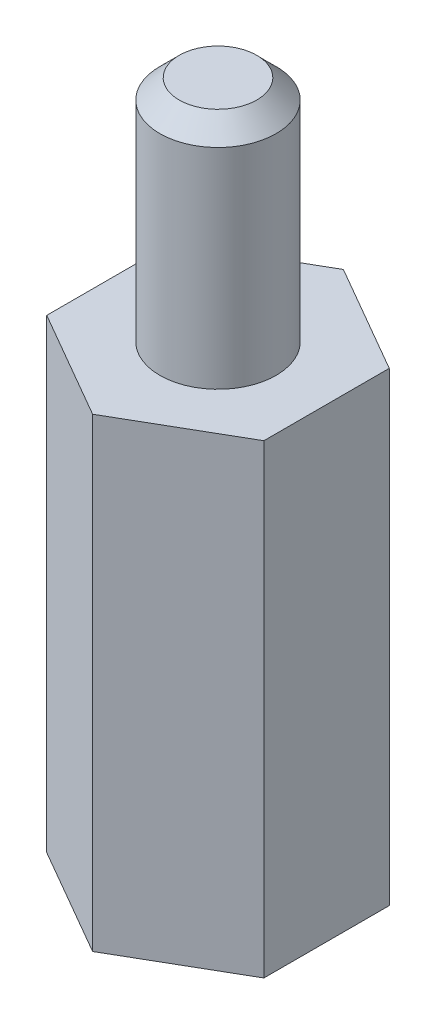
ISO-10303-21;
HEADER;
FILE_DESCRIPTION(('STEP AP214'),'2;1');
FILE_NAME('part.step','',(''),(''),'','','');
FILE_SCHEMA(('AUTOMOTIVE_DESIGN { 1 0 10303 214 1 1 1 1 }'));
ENDSEC;
DATA;
#1=APPLICATION_CONTEXT('core data for automotive mechanical design processes');
#2=APPLICATION_PROTOCOL_DEFINITION('international standard','automotive_design',2000,#1);
#3=PRODUCT_CONTEXT('',#1,'mechanical');
#4=PRODUCT('Part','Part','',(#3));
#5=PRODUCT_RELATED_PRODUCT_CATEGORY('part','',(#4));
#6=PRODUCT_DEFINITION_FORMATION('','',#4);
#7=PRODUCT_DEFINITION_CONTEXT('part definition',#1,'design');
#8=PRODUCT_DEFINITION('design','',#6,#7);
#9=PRODUCT_DEFINITION_SHAPE('','',#8);
#10=(LENGTH_UNIT() NAMED_UNIT(*) SI_UNIT(.MILLI.,.METRE.));
#11=(NAMED_UNIT(*) PLANE_ANGLE_UNIT() SI_UNIT($,.RADIAN.));
#12=(NAMED_UNIT(*) SI_UNIT($,.STERADIAN.) SOLID_ANGLE_UNIT());
#13=UNCERTAINTY_MEASURE_WITH_UNIT(LENGTH_MEASURE(1.E-05),#10,'distance_accuracy_value','');
#14=(GEOMETRIC_REPRESENTATION_CONTEXT(3) GLOBAL_UNCERTAINTY_ASSIGNED_CONTEXT((#13)) GLOBAL_UNIT_ASSIGNED_CONTEXT((#10,
#11,#12)) REPRESENTATION_CONTEXT('',''));
#15=CARTESIAN_POINT('',(0.,0.,0.));
#16=DIRECTION('',(0.,0.,1.));
#17=DIRECTION('',(1.,0.,0.));
#18=AXIS2_PLACEMENT_3D('',#15,#16,#17);
#19=CARTESIAN_POINT('',(-2.79999999999998,12.,1.61658075373099));
#20=DIRECTION('',(0.499999999999995,0.,-0.866025403784441));
#21=DIRECTION('',(-0.866025403784442,0.,-0.499999999999995));
#22=AXIS2_PLACEMENT_3D('',#19,#20,#21);
#23=PLANE('',#22);
#24=DIRECTION('',(0.866025403784442,0.,0.499999999999995));
#25=VECTOR('',#24,1.);
#26=CARTESIAN_POINT('',(-2.79999999999998,0.,1.61658075373099));
#27=LINE('',#26,#25);
#28=CARTESIAN_POINT('',(-2.79999999999998,0.,1.61658075373099));
#29=VERTEX_POINT('',#28);
#30=CARTESIAN_POINT('',(0.,0.,3.23316150746191));
#31=VERTEX_POINT('',#30);
#32=EDGE_CURVE('E135',#29,#31,#27,.T.);
#33=ORIENTED_EDGE('',*,*,#32,.T.);
#34=DIRECTION('',(0.,-1.,0.));
#35=VECTOR('',#34,1.);
#36=CARTESIAN_POINT('',(0.,12.,3.23316150746191));
#37=LINE('',#36,#35);
#38=CARTESIAN_POINT('',(0.,12.,3.23316150746191));
#39=VERTEX_POINT('',#38);
#40=EDGE_CURVE('E163',#39,#31,#37,.T.);
#41=ORIENTED_EDGE('',*,*,#40,.F.);
#42=DIRECTION('',(0.866025403784442,0.,0.499999999999995));
#43=VECTOR('',#42,1.);
#44=CARTESIAN_POINT('',(-2.79999999999998,12.,1.61658075373099));
#45=LINE('',#44,#43);
#46=CARTESIAN_POINT('',(-2.79999999999998,12.,1.61658075373099));
#47=VERTEX_POINT('',#46);
#48=EDGE_CURVE('E152',#47,#39,#45,.T.);
#49=ORIENTED_EDGE('',*,*,#48,.F.);
#50=DIRECTION('',(0.,-1.,0.));
#51=VECTOR('',#50,1.);
#52=CARTESIAN_POINT('',(-2.79999999999998,12.,1.61658075373099));
#53=LINE('',#52,#51);
#54=EDGE_CURVE('E131',#47,#29,#53,.T.);
#55=ORIENTED_EDGE('',*,*,#54,.T.);
#56=EDGE_LOOP('',(#33,#41,#49,#55));
#57=FACE_BOUND('',#56,.T.);
#58=ADVANCED_FACE('F43',(#57),#23,.F.);
#59=CARTESIAN_POINT('',(0.,12.,3.23316150746191));
#60=DIRECTION('',(-0.500000000000001,0.,-0.866025403784438));
#61=DIRECTION('',(-0.866025403784438,0.,0.500000000000001));
#62=AXIS2_PLACEMENT_3D('',#59,#60,#61);
#63=PLANE('',#62);
#64=DIRECTION('',(0.866025403784438,0.,-0.500000000000001));
#65=VECTOR('',#64,1.);
#66=CARTESIAN_POINT('',(0.,0.,3.23316150746191));
#67=LINE('',#66,#65);
#68=CARTESIAN_POINT('',(2.80000000000001,0.,1.61658075373095));
#69=VERTEX_POINT('',#68);
#70=EDGE_CURVE('E139',#31,#69,#67,.T.);
#71=ORIENTED_EDGE('',*,*,#70,.T.);
#72=DIRECTION('',(0.,-1.,0.));
#73=VECTOR('',#72,1.);
#74=CARTESIAN_POINT('',(2.80000000000001,12.,1.61658075373095));
#75=LINE('',#74,#73);
#76=CARTESIAN_POINT('',(2.80000000000001,12.,1.61658075373095));
#77=VERTEX_POINT('',#76);
#78=EDGE_CURVE('E159',#77,#69,#75,.T.);
#79=ORIENTED_EDGE('',*,*,#78,.F.);
#80=DIRECTION('',(0.866025403784438,0.,-0.500000000000001));
#81=VECTOR('',#80,1.);
#82=CARTESIAN_POINT('',(0.,12.,3.23316150746191));
#83=LINE('',#82,#81);
#84=EDGE_CURVE('E100',#39,#77,#83,.T.);
#85=ORIENTED_EDGE('',*,*,#84,.F.);
#86=ORIENTED_EDGE('',*,*,#40,.T.);
#87=EDGE_LOOP('',(#71,#79,#85,#86));
#88=FACE_BOUND('',#87,.T.);
#89=ADVANCED_FACE('F213',(#88),#63,.F.);
#90=CARTESIAN_POINT('',(2.80000000000001,12.,1.61658075373095));
#91=DIRECTION('',(-1.,0.,0.));
#92=DIRECTION('',(0.,0.,1.));
#93=AXIS2_PLACEMENT_3D('',#90,#91,#92);
#94=PLANE('',#93);
#95=DIRECTION('',(0.,0.,-1.));
#96=VECTOR('',#95,1.);
#97=CARTESIAN_POINT('',(2.80000000000001,0.,1.61658075373095));
#98=LINE('',#97,#96);
#99=CARTESIAN_POINT('',(2.79999999999999,0.,-1.61658075373097));
#100=VERTEX_POINT('',#99);
#101=EDGE_CURVE('E143',#69,#100,#98,.T.);
#102=ORIENTED_EDGE('',*,*,#101,.T.);
#103=DIRECTION('',(0.,-1.,0.));
#104=VECTOR('',#103,1.);
#105=CARTESIAN_POINT('',(2.79999999999999,12.,-1.61658075373097));
#106=LINE('',#105,#104);
#107=CARTESIAN_POINT('',(2.79999999999999,12.,-1.61658075373097));
#108=VERTEX_POINT('',#107);
#109=EDGE_CURVE('E124',#108,#100,#106,.T.);
#110=ORIENTED_EDGE('',*,*,#109,.F.);
#111=DIRECTION('',(0.,0.,-1.));
#112=VECTOR('',#111,1.);
#113=CARTESIAN_POINT('',(2.80000000000001,12.,1.61658075373095));
#114=LINE('',#113,#112);
#115=EDGE_CURVE('E113',#77,#108,#114,.T.);
#116=ORIENTED_EDGE('',*,*,#115,.F.);
#117=ORIENTED_EDGE('',*,*,#78,.T.);
#118=EDGE_LOOP('',(#102,#110,#116,#117));
#119=FACE_BOUND('',#118,.T.);
#120=ADVANCED_FACE('F217',(#119),#94,.F.);
#121=CARTESIAN_POINT('',(2.79999999999999,12.,-1.61658075373097));
#122=DIRECTION('',(-0.499999999999995,0.,0.866025403784442));
#123=DIRECTION('',(0.866025403784442,0.,0.499999999999995));
#124=AXIS2_PLACEMENT_3D('',#121,#122,#123);
#125=PLANE('',#124);
#126=DIRECTION('',(-0.866025403784442,0.,-0.499999999999995));
#127=VECTOR('',#126,1.);
#128=CARTESIAN_POINT('',(2.79999999999999,0.,-1.61658075373097));
#129=LINE('',#128,#127);
#130=CARTESIAN_POINT('',(0.,0.,-3.23316150746191));
#131=VERTEX_POINT('',#130);
#132=EDGE_CURVE('E122',#100,#131,#129,.T.);
#133=ORIENTED_EDGE('',*,*,#132,.T.);
#134=DIRECTION('',(0.,-1.,0.));
#135=VECTOR('',#134,1.);
#136=CARTESIAN_POINT('',(0.,12.,-3.23316150746191));
#137=LINE('',#136,#135);
#138=CARTESIAN_POINT('',(0.,12.,-3.23316150746191));
#139=VERTEX_POINT('',#138);
#140=EDGE_CURVE('E119',#139,#131,#137,.T.);
#141=ORIENTED_EDGE('',*,*,#140,.F.);
#142=DIRECTION('',(-0.866025403784442,0.,-0.499999999999995));
#143=VECTOR('',#142,1.);
#144=CARTESIAN_POINT('',(2.79999999999999,12.,-1.61658075373097));
#145=LINE('',#144,#143);
#146=EDGE_CURVE('E107',#108,#139,#145,.T.);
#147=ORIENTED_EDGE('',*,*,#146,.F.);
#148=ORIENTED_EDGE('',*,*,#109,.T.);
#149=EDGE_LOOP('',(#133,#141,#147,#148));
#150=FACE_BOUND('',#149,.T.);
#151=ADVANCED_FACE('F120',(#150),#125,.F.);
#152=CARTESIAN_POINT('',(0.,12.,-3.23316150746191));
#153=DIRECTION('',(0.500000000000007,0.,0.866025403784435));
#154=DIRECTION('',(0.866025403784435,0.,-0.500000000000007));
#155=AXIS2_PLACEMENT_3D('',#152,#153,#154);
#156=PLANE('',#155);
#157=DIRECTION('',(-0.866025403784435,0.,0.500000000000007));
#158=VECTOR('',#157,1.);
#159=CARTESIAN_POINT('',(0.,0.,-3.23316150746191));
#160=LINE('',#159,#158);
#161=CARTESIAN_POINT('',(-2.80000000000002,0.,-1.61658075373093));
#162=VERTEX_POINT('',#161);
#163=EDGE_CURVE('E85',#131,#162,#160,.T.);
#164=ORIENTED_EDGE('',*,*,#163,.T.);
#165=DIRECTION('',(0.,-1.,0.));
#166=VECTOR('',#165,1.);
#167=CARTESIAN_POINT('',(-2.80000000000002,12.,-1.61658075373093));
#168=LINE('',#167,#166);
#169=CARTESIAN_POINT('',(-2.80000000000002,12.,-1.61658075373093));
#170=VERTEX_POINT('',#169);
#171=EDGE_CURVE('E125',#170,#162,#168,.T.);
#172=ORIENTED_EDGE('',*,*,#171,.F.);
#173=DIRECTION('',(-0.866025403784435,0.,0.500000000000007));
#174=VECTOR('',#173,1.);
#175=CARTESIAN_POINT('',(0.,12.,-3.23316150746191));
#176=LINE('',#175,#174);
#177=EDGE_CURVE('E111',#139,#170,#176,.T.);
#178=ORIENTED_EDGE('',*,*,#177,.F.);
#179=ORIENTED_EDGE('',*,*,#140,.T.);
#180=EDGE_LOOP('',(#164,#172,#178,#179));
#181=FACE_BOUND('',#180,.T.);
#182=ADVANCED_FACE('F127',(#181),#156,.F.);
#183=CARTESIAN_POINT('',(-2.80000000000002,12.,-1.61658075373093));
#184=DIRECTION('',(1.,0.,0.));
#185=DIRECTION('',(0.,0.,-1.));
#186=AXIS2_PLACEMENT_3D('',#183,#184,#185);
#187=PLANE('',#186);
#188=DIRECTION('',(0.,0.,1.));
#189=VECTOR('',#188,1.);
#190=CARTESIAN_POINT('',(-2.80000000000002,0.,-1.61658075373093));
#191=LINE('',#190,#189);
#192=EDGE_CURVE('E91',#162,#29,#191,.T.);
#193=ORIENTED_EDGE('',*,*,#192,.T.);
#194=ORIENTED_EDGE('',*,*,#54,.F.);
#195=DIRECTION('',(0.,0.,1.));
#196=VECTOR('',#195,1.);
#197=CARTESIAN_POINT('',(-2.80000000000002,12.,-1.61658075373093));
#198=LINE('',#197,#196);
#199=EDGE_CURVE('E62',#170,#47,#198,.T.);
#200=ORIENTED_EDGE('',*,*,#199,.F.);
#201=ORIENTED_EDGE('',*,*,#171,.T.);
#202=EDGE_LOOP('',(#193,#194,#200,#201));
#203=FACE_BOUND('',#202,.T.);
#204=ADVANCED_FACE('F202',(#203),#187,.F.);
#205=CARTESIAN_POINT('',(0.,12.,0.));
#206=DIRECTION('',(0.,1.,0.));
#207=DIRECTION('',(0.,0.,1.));
#208=AXIS2_PLACEMENT_3D('',#205,#206,#207);
#209=PLANE('',#208);
#210=CARTESIAN_POINT('',(0.,12.,0.));
#211=DIRECTION('',(0.,1.,0.));
#212=DIRECTION('',(0.,0.,1.));
#213=AXIS2_PLACEMENT_3D('',#210,#211,#212);
#214=CIRCLE('',#213,1.5);
#215=CARTESIAN_POINT('',(0.,12.,1.5));
#216=VERTEX_POINT('',#215);
#217=EDGE_CURVE('E165',#216,#216,#214,.T.);
#218=ORIENTED_EDGE('',*,*,#217,.F.);
#219=EDGE_LOOP('',(#218));
#220=FACE_BOUND('',#219,.T.);
#221=ORIENTED_EDGE('',*,*,#48,.T.);
#222=ORIENTED_EDGE('',*,*,#84,.T.);
#223=ORIENTED_EDGE('',*,*,#115,.T.);
#224=ORIENTED_EDGE('',*,*,#146,.T.);
#225=ORIENTED_EDGE('',*,*,#177,.T.);
#226=ORIENTED_EDGE('',*,*,#199,.T.);
#227=EDGE_LOOP('',(#221,#222,#223,#224,#225,#226));
#228=FACE_BOUND('',#227,.T.);
#229=ADVANCED_FACE('F109',(#220,#228),#209,.T.);
#230=CARTESIAN_POINT('',(0.,0.,0.));
#231=DIRECTION('',(0.,1.,0.));
#232=DIRECTION('',(0.,0.,1.));
#233=AXIS2_PLACEMENT_3D('',#230,#231,#232);
#234=PLANE('',#233);
#235=CARTESIAN_POINT('',(0.,0.,0.));
#236=DIRECTION('',(0.,-1.,0.));
#237=DIRECTION('',(0.,0.,-1.));
#238=AXIS2_PLACEMENT_3D('',#235,#236,#237);
#239=CIRCLE('',#238,1.5);
#240=CARTESIAN_POINT('',(0.,0.,-1.5));
#241=VERTEX_POINT('',#240);
#242=EDGE_CURVE('E185',#241,#241,#239,.T.);
#243=ORIENTED_EDGE('',*,*,#242,.F.);
#244=EDGE_LOOP('',(#243));
#245=FACE_BOUND('',#244,.T.);
#246=ORIENTED_EDGE('',*,*,#32,.F.);
#247=ORIENTED_EDGE('',*,*,#192,.F.);
#248=ORIENTED_EDGE('',*,*,#163,.F.);
#249=ORIENTED_EDGE('',*,*,#132,.F.);
#250=ORIENTED_EDGE('',*,*,#101,.F.);
#251=ORIENTED_EDGE('',*,*,#70,.F.);
#252=EDGE_LOOP('',(#246,#247,#248,#249,#250,#251));
#253=FACE_BOUND('',#252,.T.);
#254=ADVANCED_FACE('F192',(#245,#253),#234,.F.);
#255=CARTESIAN_POINT('',(0.,17.9,0.));
#256=DIRECTION('',(0.,-1.,0.));
#257=DIRECTION('',(0.,0.,-1.));
#258=AXIS2_PLACEMENT_3D('',#255,#256,#257);
#259=CYLINDRICAL_SURFACE('',#258,1.5);
#260=CARTESIAN_POINT('',(0.,17.4,0.));
#261=DIRECTION('',(0.,1.,0.));
#262=DIRECTION('',(0.,0.,1.));
#263=AXIS2_PLACEMENT_3D('',#260,#261,#262);
#264=CIRCLE('',#263,1.5);
#265=CARTESIAN_POINT('',(0.,17.4,1.5));
#266=VERTEX_POINT('',#265);
#267=EDGE_CURVE('E12',#266,#266,#264,.F.);
#268=ORIENTED_EDGE('',*,*,#267,.T.);
#269=EDGE_LOOP('',(#268));
#270=FACE_BOUND('',#269,.T.);
#271=ORIENTED_EDGE('',*,*,#217,.T.);
#272=EDGE_LOOP('',(#271));
#273=FACE_BOUND('',#272,.T.);
#274=ADVANCED_FACE('F195',(#270,#273),#259,.T.);
#275=CARTESIAN_POINT('',(0.,17.9,0.));
#276=DIRECTION('',(0.,1.,0.));
#277=DIRECTION('',(0.,0.,1.));
#278=AXIS2_PLACEMENT_3D('',#275,#276,#277);
#279=PLANE('',#278);
#280=CARTESIAN_POINT('',(0.,17.9,0.));
#281=DIRECTION('',(0.,1.,0.));
#282=DIRECTION('',(0.,0.,1.));
#283=AXIS2_PLACEMENT_3D('',#280,#281,#282);
#284=CIRCLE('',#283,1.);
#285=CARTESIAN_POINT('',(0.,17.9,1.));
#286=VERTEX_POINT('',#285);
#287=EDGE_CURVE('E54',#286,#286,#284,.T.);
#288=ORIENTED_EDGE('',*,*,#287,.T.);
#289=EDGE_LOOP('',(#288));
#290=FACE_BOUND('',#289,.T.);
#291=ADVANCED_FACE('F260',(#290),#279,.T.);
#292=CARTESIAN_POINT('',(0.,10.,0.));
#293=DIRECTION('',(0.,1.,0.));
#294=DIRECTION('',(0.,0.,1.));
#295=AXIS2_PLACEMENT_3D('',#292,#293,#294);
#296=PLANE('',#295);
#297=CARTESIAN_POINT('',(0.,10.,0.));
#298=DIRECTION('',(0.,1.,0.));
#299=DIRECTION('',(0.,0.,1.));
#300=AXIS2_PLACEMENT_3D('',#297,#298,#299);
#301=CIRCLE('',#300,1.5);
#302=CARTESIAN_POINT('',(0.,10.,1.5));
#303=VERTEX_POINT('',#302);
#304=EDGE_CURVE('E140',#303,#303,#301,.F.);
#305=ORIENTED_EDGE('',*,*,#304,.T.);
#306=EDGE_LOOP('',(#305));
#307=FACE_BOUND('',#306,.T.);
#308=ADVANCED_FACE('F255',(#307),#296,.F.);
#309=CARTESIAN_POINT('',(0.,16.2426406871193,0.));
#310=DIRECTION('',(0.,-1.,0.));
#311=DIRECTION('',(0.,0.,-1.));
#312=AXIS2_PLACEMENT_3D('',#309,#310,#311);
#313=CYLINDRICAL_SURFACE('',#312,1.5);
#314=ORIENTED_EDGE('',*,*,#242,.T.);
#315=EDGE_LOOP('',(#314));
#316=FACE_BOUND('',#315,.T.);
#317=ORIENTED_EDGE('',*,*,#304,.F.);
#318=EDGE_LOOP('',(#317));
#319=FACE_BOUND('',#318,.T.);
#320=ADVANCED_FACE('F189',(#316,#319),#313,.F.);
#321=CARTESIAN_POINT('',(0.,17.9,0.));
#322=DIRECTION('',(0.,-1.,0.));
#323=DIRECTION('',(0.,0.,-1.));
#324=AXIS2_PLACEMENT_3D('',#321,#322,#323);
#325=CONICAL_SURFACE('',#324,1.,0.785398163397446);
#326=ORIENTED_EDGE('',*,*,#267,.F.);
#327=EDGE_LOOP('',(#326));
#328=FACE_BOUND('',#327,.T.);
#329=ORIENTED_EDGE('',*,*,#287,.F.);
#330=EDGE_LOOP('',(#329));
#331=FACE_BOUND('',#330,.T.);
#332=ADVANCED_FACE('F46',(#328,#331),#325,.T.);
#333=CLOSED_SHELL('',(#58,#89,#120,#151,#182,#204,#229,#254,#274,#291,#308,#320,#332));
#334=MANIFOLD_SOLID_BREP('B2',#333);
#335=ADVANCED_BREP_SHAPE_REPRESENTATION('',(#18,#334),#14);
#336=SHAPE_DEFINITION_REPRESENTATION(#9,#335);
ENDSEC;
END-ISO-10303-21;
